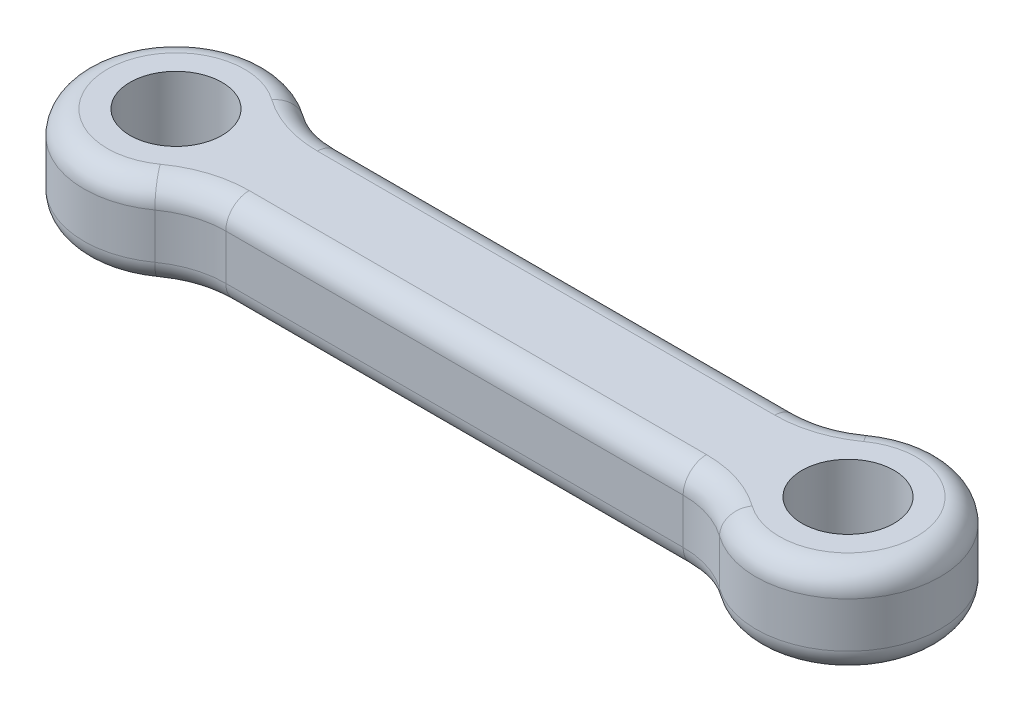
ISO-10303-21;
HEADER;
FILE_DESCRIPTION(('STEP AP214'),'2;1');
FILE_NAME('part.step','',(''),(''),'','','');
FILE_SCHEMA(('AUTOMOTIVE_DESIGN { 1 0 10303 214 1 1 1 1 }'));
ENDSEC;
DATA;
#1=APPLICATION_CONTEXT('core data for automotive mechanical design processes');
#2=APPLICATION_PROTOCOL_DEFINITION('international standard','automotive_design',2000,#1);
#3=PRODUCT_CONTEXT('',#1,'mechanical');
#4=PRODUCT('Part','Part','',(#3));
#5=PRODUCT_RELATED_PRODUCT_CATEGORY('part','',(#4));
#6=PRODUCT_DEFINITION_FORMATION('','',#4);
#7=PRODUCT_DEFINITION_CONTEXT('part definition',#1,'design');
#8=PRODUCT_DEFINITION('design','',#6,#7);
#9=PRODUCT_DEFINITION_SHAPE('','',#8);
#10=(LENGTH_UNIT() NAMED_UNIT(*) SI_UNIT(.MILLI.,.METRE.));
#11=(NAMED_UNIT(*) PLANE_ANGLE_UNIT() SI_UNIT($,.RADIAN.));
#12=(NAMED_UNIT(*) SI_UNIT($,.STERADIAN.) SOLID_ANGLE_UNIT());
#13=UNCERTAINTY_MEASURE_WITH_UNIT(LENGTH_MEASURE(1.E-05),#10,'distance_accuracy_value','');
#14=(GEOMETRIC_REPRESENTATION_CONTEXT(3) GLOBAL_UNCERTAINTY_ASSIGNED_CONTEXT((#13)) GLOBAL_UNIT_ASSIGNED_CONTEXT((#10,
#11,#12)) REPRESENTATION_CONTEXT('',''));
#15=CARTESIAN_POINT('',(0.,0.,0.));
#16=DIRECTION('',(0.,0.,1.));
#17=DIRECTION('',(1.,0.,0.));
#18=AXIS2_PLACEMENT_3D('',#15,#16,#17);
#19=CARTESIAN_POINT('',(1.85508771879827,8.3,-10.725));
#20=DIRECTION('',(0.,1.,0.));
#21=DIRECTION('',(0.,0.,1.));
#22=AXIS2_PLACEMENT_3D('',#19,#20,#21);
#23=PLANE('',#22);
#24=CARTESIAN_POINT('',(34.6449122812017,8.3,10.725));
#25=DIRECTION('',(0.,1.,0.));
#26=DIRECTION('',(0.,0.,1.));
#27=AXIS2_PLACEMENT_3D('',#24,#25,#26);
#28=CIRCLE('',#27,8.2764);
#29=CARTESIAN_POINT('',(34.6449122812017,8.3,2.4486));
#30=VERTEX_POINT('',#29);
#31=CARTESIAN_POINT('',(39.4697322808882,8.3,4.000425));
#32=VERTEX_POINT('',#31);
#33=EDGE_CURVE('E268',#30,#32,#28,.F.);
#34=ORIENTED_EDGE('',*,*,#33,.T.);
#35=CARTESIAN_POINT('',(42.34,8.3,0.));
#36=DIRECTION('',(0.,1.,0.));
#37=DIRECTION('',(0.,0.,1.));
#38=AXIS2_PLACEMENT_3D('',#35,#36,#37);
#39=CIRCLE('',#38,4.9236);
#40=CARTESIAN_POINT('',(39.4697322808882,8.3,-4.000425));
#41=VERTEX_POINT('',#40);
#42=EDGE_CURVE('E155',#32,#41,#39,.T.);
#43=ORIENTED_EDGE('',*,*,#42,.T.);
#44=CARTESIAN_POINT('',(34.6449122812017,8.3,-10.725));
#45=DIRECTION('',(0.,1.,0.));
#46=DIRECTION('',(0.,0.,1.));
#47=AXIS2_PLACEMENT_3D('',#44,#45,#46);
#48=CIRCLE('',#47,8.2764);
#49=CARTESIAN_POINT('',(34.6449122812017,8.3,-2.4486));
#50=VERTEX_POINT('',#49);
#51=EDGE_CURVE('E149',#41,#50,#48,.F.);
#52=ORIENTED_EDGE('',*,*,#51,.T.);
#53=DIRECTION('',(-1.,0.,0.));
#54=VECTOR('',#53,1.);
#55=CARTESIAN_POINT('',(1.85508771879827,8.3,-2.4486));
#56=LINE('',#55,#54);
#57=CARTESIAN_POINT('',(1.85508771879827,8.3,-2.4486));
#58=VERTEX_POINT('',#57);
#59=EDGE_CURVE('E152',#50,#58,#56,.T.);
#60=ORIENTED_EDGE('',*,*,#59,.T.);
#61=CARTESIAN_POINT('',(1.85508771879827,8.3,-10.725));
#62=DIRECTION('',(0.,1.,0.));
#63=DIRECTION('',(0.,0.,1.));
#64=AXIS2_PLACEMENT_3D('',#61,#62,#63);
#65=CIRCLE('',#64,8.2764);
#66=CARTESIAN_POINT('',(-2.96973228088825,8.3,-4.000425));
#67=VERTEX_POINT('',#66);
#68=EDGE_CURVE('E159',#58,#67,#65,.F.);
#69=ORIENTED_EDGE('',*,*,#68,.T.);
#70=CARTESIAN_POINT('',(-5.84000000000001,8.3,0.));
#71=DIRECTION('',(0.,1.,0.));
#72=DIRECTION('',(0.,0.,1.));
#73=AXIS2_PLACEMENT_3D('',#70,#71,#72);
#74=CIRCLE('',#73,4.9236);
#75=CARTESIAN_POINT('',(-2.96973228088825,8.3,4.000425));
#76=VERTEX_POINT('',#75);
#77=EDGE_CURVE('E274',#67,#76,#74,.T.);
#78=ORIENTED_EDGE('',*,*,#77,.T.);
#79=CARTESIAN_POINT('',(1.85508771879827,8.3,10.725));
#80=DIRECTION('',(0.,1.,0.));
#81=DIRECTION('',(0.,0.,1.));
#82=AXIS2_PLACEMENT_3D('',#79,#80,#81);
#83=CIRCLE('',#82,8.2764);
#84=CARTESIAN_POINT('',(1.85508771879827,8.3,2.4486));
#85=VERTEX_POINT('',#84);
#86=EDGE_CURVE('E272',#76,#85,#83,.F.);
#87=ORIENTED_EDGE('',*,*,#86,.T.);
#88=DIRECTION('',(1.,0.,0.));
#89=VECTOR('',#88,1.);
#90=CARTESIAN_POINT('',(34.6449122812017,8.3,2.4486));
#91=LINE('',#90,#89);
#92=EDGE_CURVE('E270',#85,#30,#91,.T.);
#93=ORIENTED_EDGE('',*,*,#92,.T.);
#94=EDGE_LOOP('',(#34,#43,#52,#60,#69,#78,#87,#93));
#95=FACE_BOUND('',#94,.T.);
#96=CARTESIAN_POINT('',(-5.84000000000001,8.3,0.));
#97=DIRECTION('',(0.,1.,0.));
#98=DIRECTION('',(0.,0.,1.));
#99=AXIS2_PLACEMENT_3D('',#96,#97,#98);
#100=CIRCLE('',#99,3.3);
#101=CARTESIAN_POINT('',(-5.84000000000001,8.3,3.3));
#102=VERTEX_POINT('',#101);
#103=EDGE_CURVE('E298',#102,#102,#100,.T.);
#104=ORIENTED_EDGE('',*,*,#103,.F.);
#105=EDGE_LOOP('',(#104));
#106=FACE_BOUND('',#105,.T.);
#107=CARTESIAN_POINT('',(42.34,8.3,0.));
#108=DIRECTION('',(0.,1.,0.));
#109=DIRECTION('',(0.,0.,-1.));
#110=AXIS2_PLACEMENT_3D('',#107,#108,#109);
#111=CIRCLE('',#110,3.3);
#112=CARTESIAN_POINT('',(42.34,8.3,-3.3));
#113=VERTEX_POINT('',#112);
#114=EDGE_CURVE('E302',#113,#113,#111,.T.);
#115=ORIENTED_EDGE('',*,*,#114,.F.);
#116=EDGE_LOOP('',(#115));
#117=FACE_BOUND('',#116,.T.);
#118=ADVANCED_FACE('F34',(#95,#106,#117),#23,.T.);
#119=CARTESIAN_POINT('',(1.85508771879827,1.7,-10.725));
#120=DIRECTION('',(0.,1.,0.));
#121=DIRECTION('',(0.,0.,1.));
#122=AXIS2_PLACEMENT_3D('',#119,#120,#121);
#123=PLANE('',#122);
#124=CARTESIAN_POINT('',(1.85508771879827,1.7,10.725));
#125=DIRECTION('',(0.,1.,0.));
#126=DIRECTION('',(0.,0.,1.));
#127=AXIS2_PLACEMENT_3D('',#124,#125,#126);
#128=CIRCLE('',#127,8.2764);
#129=CARTESIAN_POINT('',(1.85508771879827,1.7,2.4486));
#130=VERTEX_POINT('',#129);
#131=CARTESIAN_POINT('',(-2.96973228088825,1.7,4.000425));
#132=VERTEX_POINT('',#131);
#133=EDGE_CURVE('E227',#130,#132,#128,.T.);
#134=ORIENTED_EDGE('',*,*,#133,.T.);
#135=CARTESIAN_POINT('',(-5.84000000000001,1.7,0.));
#136=DIRECTION('',(0.,1.,0.));
#137=DIRECTION('',(0.,0.,1.));
#138=AXIS2_PLACEMENT_3D('',#135,#136,#137);
#139=CIRCLE('',#138,4.9236);
#140=CARTESIAN_POINT('',(-2.96973228088825,1.7,-4.000425));
#141=VERTEX_POINT('',#140);
#142=EDGE_CURVE('E224',#132,#141,#139,.F.);
#143=ORIENTED_EDGE('',*,*,#142,.T.);
#144=CARTESIAN_POINT('',(1.85508771879827,1.7,-10.725));
#145=DIRECTION('',(0.,1.,0.));
#146=DIRECTION('',(0.,0.,1.));
#147=AXIS2_PLACEMENT_3D('',#144,#145,#146);
#148=CIRCLE('',#147,8.2764);
#149=CARTESIAN_POINT('',(1.85508771879827,1.7,-2.4486));
#150=VERTEX_POINT('',#149);
#151=EDGE_CURVE('E239',#141,#150,#148,.T.);
#152=ORIENTED_EDGE('',*,*,#151,.T.);
#153=DIRECTION('',(-1.,0.,0.));
#154=VECTOR('',#153,1.);
#155=CARTESIAN_POINT('',(1.85508771879827,1.7,-2.4486));
#156=LINE('',#155,#154);
#157=CARTESIAN_POINT('',(34.6449122812017,1.7,-2.4486));
#158=VERTEX_POINT('',#157);
#159=EDGE_CURVE('E237',#150,#158,#156,.F.);
#160=ORIENTED_EDGE('',*,*,#159,.T.);
#161=CARTESIAN_POINT('',(34.6449122812017,1.7,-10.725));
#162=DIRECTION('',(0.,1.,0.));
#163=DIRECTION('',(0.,0.,1.));
#164=AXIS2_PLACEMENT_3D('',#161,#162,#163);
#165=CIRCLE('',#164,8.2764);
#166=CARTESIAN_POINT('',(39.4697322808882,1.7,-4.000425));
#167=VERTEX_POINT('',#166);
#168=EDGE_CURVE('E235',#158,#167,#165,.T.);
#169=ORIENTED_EDGE('',*,*,#168,.T.);
#170=CARTESIAN_POINT('',(42.34,1.7,0.));
#171=DIRECTION('',(0.,1.,0.));
#172=DIRECTION('',(0.,0.,1.));
#173=AXIS2_PLACEMENT_3D('',#170,#171,#172);
#174=CIRCLE('',#173,4.9236);
#175=CARTESIAN_POINT('',(39.4697322808882,1.7,4.000425));
#176=VERTEX_POINT('',#175);
#177=EDGE_CURVE('E233',#167,#176,#174,.F.);
#178=ORIENTED_EDGE('',*,*,#177,.T.);
#179=CARTESIAN_POINT('',(34.6449122812017,1.7,10.725));
#180=DIRECTION('',(0.,1.,0.));
#181=DIRECTION('',(0.,0.,1.));
#182=AXIS2_PLACEMENT_3D('',#179,#180,#181);
#183=CIRCLE('',#182,8.2764);
#184=CARTESIAN_POINT('',(34.6449122812017,1.7,2.4486));
#185=VERTEX_POINT('',#184);
#186=EDGE_CURVE('E231',#176,#185,#183,.T.);
#187=ORIENTED_EDGE('',*,*,#186,.T.);
#188=DIRECTION('',(1.,0.,0.));
#189=VECTOR('',#188,1.);
#190=CARTESIAN_POINT('',(1.85508771879827,1.7,2.4486));
#191=LINE('',#190,#189);
#192=EDGE_CURVE('E229',#185,#130,#191,.F.);
#193=ORIENTED_EDGE('',*,*,#192,.T.);
#194=EDGE_LOOP('',(#134,#143,#152,#160,#169,#178,#187,#193));
#195=FACE_BOUND('',#194,.T.);
#196=CARTESIAN_POINT('',(-5.84000000000001,1.7,0.));
#197=DIRECTION('',(0.,1.,0.));
#198=DIRECTION('',(0.,0.,1.));
#199=AXIS2_PLACEMENT_3D('',#196,#197,#198);
#200=CIRCLE('',#199,3.3);
#201=CARTESIAN_POINT('',(-5.84000000000001,1.7,3.3));
#202=VERTEX_POINT('',#201);
#203=EDGE_CURVE('E299',#202,#202,#200,.T.);
#204=ORIENTED_EDGE('',*,*,#203,.T.);
#205=EDGE_LOOP('',(#204));
#206=FACE_BOUND('',#205,.T.);
#207=CARTESIAN_POINT('',(42.34,1.7,0.));
#208=DIRECTION('',(0.,1.,0.));
#209=DIRECTION('',(0.,0.,-1.));
#210=AXIS2_PLACEMENT_3D('',#207,#208,#209);
#211=CIRCLE('',#210,3.3);
#212=CARTESIAN_POINT('',(42.34,1.7,-3.3));
#213=VERTEX_POINT('',#212);
#214=EDGE_CURVE('E192',#213,#213,#211,.T.);
#215=ORIENTED_EDGE('',*,*,#214,.T.);
#216=EDGE_LOOP('',(#215));
#217=FACE_BOUND('',#216,.T.);
#218=ADVANCED_FACE('F314',(#195,#206,#217),#123,.F.);
#219=CARTESIAN_POINT('',(1.85508771879827,8.3,-10.725));
#220=DIRECTION('',(0.,-1.,0.));
#221=DIRECTION('',(0.,0.,-1.));
#222=AXIS2_PLACEMENT_3D('',#219,#220,#221);
#223=CYLINDRICAL_SURFACE('',#222,6.6);
#224=DIRECTION('',(0.,-1.,0.));
#225=VECTOR('',#224,1.);
#226=CARTESIAN_POINT('',(-1.99245614060087,8.3,-5.3625));
#227=LINE('',#226,#225);
#228=CARTESIAN_POINT('',(-1.99245614060087,6.6236,-5.3625));
#229=VERTEX_POINT('',#228);
#230=CARTESIAN_POINT('',(-1.99245614060087,3.3764,-5.3625));
#231=VERTEX_POINT('',#230);
#232=EDGE_CURVE('E169',#229,#231,#227,.T.);
#233=ORIENTED_EDGE('',*,*,#232,.F.);
#234=CARTESIAN_POINT('',(1.85508771879827,6.6236,-10.725));
#235=DIRECTION('',(0.,1.,0.));
#236=DIRECTION('',(0.,0.,1.));
#237=AXIS2_PLACEMENT_3D('',#234,#235,#236);
#238=CIRCLE('',#237,6.6);
#239=CARTESIAN_POINT('',(1.85508771879827,6.6236,-4.125));
#240=VERTEX_POINT('',#239);
#241=EDGE_CURVE('E241',#229,#240,#238,.T.);
#242=ORIENTED_EDGE('',*,*,#241,.T.);
#243=DIRECTION('',(0.,-1.,0.));
#244=VECTOR('',#243,1.);
#245=CARTESIAN_POINT('',(1.85508771879827,8.3,-4.125));
#246=LINE('',#245,#244);
#247=CARTESIAN_POINT('',(1.85508771879827,3.3764,-4.125));
#248=VERTEX_POINT('',#247);
#249=EDGE_CURVE('E295',#240,#248,#246,.T.);
#250=ORIENTED_EDGE('',*,*,#249,.T.);
#251=CARTESIAN_POINT('',(1.85508771879827,3.3764,-10.725));
#252=DIRECTION('',(0.,1.,0.));
#253=DIRECTION('',(0.,0.,1.));
#254=AXIS2_PLACEMENT_3D('',#251,#252,#253);
#255=CIRCLE('',#254,6.6);
#256=EDGE_CURVE('E243',#248,#231,#255,.F.);
#257=ORIENTED_EDGE('',*,*,#256,.T.);
#258=EDGE_LOOP('',(#233,#242,#250,#257));
#259=FACE_BOUND('',#258,.T.);
#260=ADVANCED_FACE('F319',(#259),#223,.F.);
#261=CARTESIAN_POINT('',(-5.84000000000001,8.3,0.));
#262=DIRECTION('',(0.,-1.,0.));
#263=DIRECTION('',(0.,0.,-1.));
#264=AXIS2_PLACEMENT_3D('',#261,#262,#263);
#265=CYLINDRICAL_SURFACE('',#264,6.6);
#266=DIRECTION('',(0.,-1.,0.));
#267=VECTOR('',#266,1.);
#268=CARTESIAN_POINT('',(-1.99245614060087,8.3,5.3625));
#269=LINE('',#268,#267);
#270=CARTESIAN_POINT('',(-1.99245614060087,6.6236,5.3625));
#271=VERTEX_POINT('',#270);
#272=CARTESIAN_POINT('',(-1.99245614060087,3.3764,5.3625));
#273=VERTEX_POINT('',#272);
#274=EDGE_CURVE('E279',#271,#273,#269,.T.);
#275=ORIENTED_EDGE('',*,*,#274,.F.);
#276=CARTESIAN_POINT('',(-5.84000000000001,6.6236,0.));
#277=DIRECTION('',(0.,1.,0.));
#278=DIRECTION('',(0.,0.,1.));
#279=AXIS2_PLACEMENT_3D('',#276,#277,#278);
#280=CIRCLE('',#279,6.6);
#281=EDGE_CURVE('E245',#271,#229,#280,.F.);
#282=ORIENTED_EDGE('',*,*,#281,.T.);
#283=ORIENTED_EDGE('',*,*,#232,.T.);
#284=CARTESIAN_POINT('',(-5.84000000000001,3.3764,0.));
#285=DIRECTION('',(0.,1.,0.));
#286=DIRECTION('',(0.,0.,1.));
#287=AXIS2_PLACEMENT_3D('',#284,#285,#286);
#288=CIRCLE('',#287,6.6);
#289=EDGE_CURVE('E247',#231,#273,#288,.T.);
#290=ORIENTED_EDGE('',*,*,#289,.T.);
#291=EDGE_LOOP('',(#275,#282,#283,#290));
#292=FACE_BOUND('',#291,.T.);
#293=ADVANCED_FACE('F347',(#292),#265,.T.);
#294=CARTESIAN_POINT('',(1.85508771879827,8.3,10.725));
#295=DIRECTION('',(0.,-1.,0.));
#296=DIRECTION('',(0.,0.,-1.));
#297=AXIS2_PLACEMENT_3D('',#294,#295,#296);
#298=CYLINDRICAL_SURFACE('',#297,6.6);
#299=DIRECTION('',(0.,-1.,0.));
#300=VECTOR('',#299,1.);
#301=CARTESIAN_POINT('',(1.85508771879827,8.3,4.125));
#302=LINE('',#301,#300);
#303=CARTESIAN_POINT('',(1.85508771879827,6.6236,4.125));
#304=VERTEX_POINT('',#303);
#305=CARTESIAN_POINT('',(1.85508771879827,3.3764,4.125));
#306=VERTEX_POINT('',#305);
#307=EDGE_CURVE('E282',#304,#306,#302,.T.);
#308=ORIENTED_EDGE('',*,*,#307,.F.);
#309=CARTESIAN_POINT('',(1.85508771879827,6.6236,10.725));
#310=DIRECTION('',(0.,1.,0.));
#311=DIRECTION('',(0.,0.,1.));
#312=AXIS2_PLACEMENT_3D('',#309,#310,#311);
#313=CIRCLE('',#312,6.6);
#314=EDGE_CURVE('E250',#304,#271,#313,.T.);
#315=ORIENTED_EDGE('',*,*,#314,.T.);
#316=ORIENTED_EDGE('',*,*,#274,.T.);
#317=CARTESIAN_POINT('',(1.85508771879827,3.3764,10.725));
#318=DIRECTION('',(0.,1.,0.));
#319=DIRECTION('',(0.,0.,1.));
#320=AXIS2_PLACEMENT_3D('',#317,#318,#319);
#321=CIRCLE('',#320,6.6);
#322=EDGE_CURVE('E252',#273,#306,#321,.F.);
#323=ORIENTED_EDGE('',*,*,#322,.T.);
#324=EDGE_LOOP('',(#308,#315,#316,#323));
#325=FACE_BOUND('',#324,.T.);
#326=ADVANCED_FACE('F343',(#325),#298,.F.);
#327=CARTESIAN_POINT('',(1.85508771879827,8.3,4.125));
#328=DIRECTION('',(0.,0.,-1.));
#329=DIRECTION('',(-1.,0.,0.));
#330=AXIS2_PLACEMENT_3D('',#327,#328,#329);
#331=PLANE('',#330);
#332=DIRECTION('',(0.,-1.,0.));
#333=VECTOR('',#332,1.);
#334=CARTESIAN_POINT('',(34.6449122812017,8.3,4.125));
#335=LINE('',#334,#333);
#336=CARTESIAN_POINT('',(34.6449122812017,6.6236,4.125));
#337=VERTEX_POINT('',#336);
#338=CARTESIAN_POINT('',(34.6449122812017,3.3764,4.125));
#339=VERTEX_POINT('',#338);
#340=EDGE_CURVE('E285',#337,#339,#335,.T.);
#341=ORIENTED_EDGE('',*,*,#340,.F.);
#342=DIRECTION('',(1.,0.,0.));
#343=VECTOR('',#342,1.);
#344=CARTESIAN_POINT('',(1.85508771879827,6.6236,4.125));
#345=LINE('',#344,#343);
#346=EDGE_CURVE('E254',#337,#304,#345,.F.);
#347=ORIENTED_EDGE('',*,*,#346,.T.);
#348=ORIENTED_EDGE('',*,*,#307,.T.);
#349=DIRECTION('',(1.,0.,0.));
#350=VECTOR('',#349,1.);
#351=CARTESIAN_POINT('',(1.85508771879827,3.3764,4.125));
#352=LINE('',#351,#350);
#353=EDGE_CURVE('E256',#306,#339,#352,.T.);
#354=ORIENTED_EDGE('',*,*,#353,.T.);
#355=EDGE_LOOP('',(#341,#347,#348,#354));
#356=FACE_BOUND('',#355,.T.);
#357=ADVANCED_FACE('F339',(#356),#331,.F.);
#358=CARTESIAN_POINT('',(34.6449122812017,8.3,10.725));
#359=DIRECTION('',(0.,-1.,0.));
#360=DIRECTION('',(0.,0.,-1.));
#361=AXIS2_PLACEMENT_3D('',#358,#359,#360);
#362=CYLINDRICAL_SURFACE('',#361,6.6);
#363=DIRECTION('',(0.,-1.,0.));
#364=VECTOR('',#363,1.);
#365=CARTESIAN_POINT('',(38.4924561406009,8.3,5.3625));
#366=LINE('',#365,#364);
#367=CARTESIAN_POINT('',(38.4924561406009,6.6236,5.3625));
#368=VERTEX_POINT('',#367);
#369=CARTESIAN_POINT('',(38.4924561406009,3.3764,5.3625));
#370=VERTEX_POINT('',#369);
#371=EDGE_CURVE('E288',#368,#370,#366,.T.);
#372=ORIENTED_EDGE('',*,*,#371,.F.);
#373=CARTESIAN_POINT('',(34.6449122812017,6.6236,10.725));
#374=DIRECTION('',(0.,1.,0.));
#375=DIRECTION('',(0.,0.,1.));
#376=AXIS2_PLACEMENT_3D('',#373,#374,#375);
#377=CIRCLE('',#376,6.6);
#378=EDGE_CURVE('E258',#368,#337,#377,.T.);
#379=ORIENTED_EDGE('',*,*,#378,.T.);
#380=ORIENTED_EDGE('',*,*,#340,.T.);
#381=CARTESIAN_POINT('',(34.6449122812017,3.3764,10.725));
#382=DIRECTION('',(0.,1.,0.));
#383=DIRECTION('',(0.,0.,1.));
#384=AXIS2_PLACEMENT_3D('',#381,#382,#383);
#385=CIRCLE('',#384,6.6);
#386=EDGE_CURVE('E260',#339,#370,#385,.F.);
#387=ORIENTED_EDGE('',*,*,#386,.T.);
#388=EDGE_LOOP('',(#372,#379,#380,#387));
#389=FACE_BOUND('',#388,.T.);
#390=ADVANCED_FACE('F335',(#389),#362,.F.);
#391=CARTESIAN_POINT('',(42.34,8.3,0.));
#392=DIRECTION('',(0.,-1.,0.));
#393=DIRECTION('',(0.,0.,-1.));
#394=AXIS2_PLACEMENT_3D('',#391,#392,#393);
#395=CYLINDRICAL_SURFACE('',#394,6.6);
#396=DIRECTION('',(0.,-1.,0.));
#397=VECTOR('',#396,1.);
#398=CARTESIAN_POINT('',(38.4924561406009,8.3,-5.3625));
#399=LINE('',#398,#397);
#400=CARTESIAN_POINT('',(38.4924561406009,6.6236,-5.3625));
#401=VERTEX_POINT('',#400);
#402=CARTESIAN_POINT('',(38.4924561406009,3.3764,-5.3625));
#403=VERTEX_POINT('',#402);
#404=EDGE_CURVE('E291',#401,#403,#399,.T.);
#405=ORIENTED_EDGE('',*,*,#404,.F.);
#406=CARTESIAN_POINT('',(42.34,6.6236,0.));
#407=DIRECTION('',(0.,1.,0.));
#408=DIRECTION('',(0.,0.,1.));
#409=AXIS2_PLACEMENT_3D('',#406,#407,#408);
#410=CIRCLE('',#409,6.6);
#411=EDGE_CURVE('E262',#401,#368,#410,.F.);
#412=ORIENTED_EDGE('',*,*,#411,.T.);
#413=ORIENTED_EDGE('',*,*,#371,.T.);
#414=CARTESIAN_POINT('',(42.34,3.3764,0.));
#415=DIRECTION('',(0.,1.,0.));
#416=DIRECTION('',(0.,0.,1.));
#417=AXIS2_PLACEMENT_3D('',#414,#415,#416);
#418=CIRCLE('',#417,6.6);
#419=EDGE_CURVE('E265',#370,#403,#418,.T.);
#420=ORIENTED_EDGE('',*,*,#419,.T.);
#421=EDGE_LOOP('',(#405,#412,#413,#420));
#422=FACE_BOUND('',#421,.T.);
#423=ADVANCED_FACE('F332',(#422),#395,.T.);
#424=CARTESIAN_POINT('',(34.6449122812017,8.3,-10.725));
#425=DIRECTION('',(0.,-1.,0.));
#426=DIRECTION('',(0.,0.,-1.));
#427=AXIS2_PLACEMENT_3D('',#424,#425,#426);
#428=CYLINDRICAL_SURFACE('',#427,6.6);
#429=ORIENTED_EDGE('',*,*,#404,.T.);
#430=CARTESIAN_POINT('',(34.6449122812017,3.3764,-10.725));
#431=DIRECTION('',(0.,1.,0.));
#432=DIRECTION('',(0.,0.,1.));
#433=AXIS2_PLACEMENT_3D('',#430,#431,#432);
#434=CIRCLE('',#433,6.6);
#435=CARTESIAN_POINT('',(34.6449122812017,3.3764,-4.125));
#436=VERTEX_POINT('',#435);
#437=EDGE_CURVE('E51',#403,#436,#434,.F.);
#438=ORIENTED_EDGE('',*,*,#437,.T.);
#439=DIRECTION('',(0.,-1.,0.));
#440=VECTOR('',#439,1.);
#441=CARTESIAN_POINT('',(34.6449122812017,8.3,-4.125));
#442=LINE('',#441,#440);
#443=CARTESIAN_POINT('',(34.6449122812017,6.6236,-4.125));
#444=VERTEX_POINT('',#443);
#445=EDGE_CURVE('E293',#444,#436,#442,.T.);
#446=ORIENTED_EDGE('',*,*,#445,.F.);
#447=CARTESIAN_POINT('',(34.6449122812017,6.6236,-10.725));
#448=DIRECTION('',(0.,1.,0.));
#449=DIRECTION('',(0.,0.,1.));
#450=AXIS2_PLACEMENT_3D('',#447,#448,#449);
#451=CIRCLE('',#450,6.6);
#452=EDGE_CURVE('E172',#444,#401,#451,.T.);
#453=ORIENTED_EDGE('',*,*,#452,.T.);
#454=EDGE_LOOP('',(#429,#438,#446,#453));
#455=FACE_BOUND('',#454,.T.);
#456=ADVANCED_FACE('F329',(#455),#428,.F.);
#457=CARTESIAN_POINT('',(1.85508771879827,8.3,-4.125));
#458=DIRECTION('',(0.,0.,1.));
#459=DIRECTION('',(1.,0.,0.));
#460=AXIS2_PLACEMENT_3D('',#457,#458,#459);
#461=PLANE('',#460);
#462=ORIENTED_EDGE('',*,*,#445,.T.);
#463=DIRECTION('',(-1.,0.,0.));
#464=VECTOR('',#463,1.);
#465=CARTESIAN_POINT('',(1.85508771879827,3.3764,-4.125));
#466=LINE('',#465,#464);
#467=EDGE_CURVE('E11',#436,#248,#466,.T.);
#468=ORIENTED_EDGE('',*,*,#467,.T.);
#469=ORIENTED_EDGE('',*,*,#249,.F.);
#470=DIRECTION('',(-1.,0.,0.));
#471=VECTOR('',#470,1.);
#472=CARTESIAN_POINT('',(34.6449122812017,6.6236,-4.125));
#473=LINE('',#472,#471);
#474=EDGE_CURVE('E43',#240,#444,#473,.F.);
#475=ORIENTED_EDGE('',*,*,#474,.T.);
#476=EDGE_LOOP('',(#462,#468,#469,#475));
#477=FACE_BOUND('',#476,.T.);
#478=ADVANCED_FACE('F326',(#477),#461,.F.);
#479=CARTESIAN_POINT('',(-5.84000000000001,8.3,0.));
#480=DIRECTION('',(0.,-1.,0.));
#481=DIRECTION('',(0.,0.,-1.));
#482=AXIS2_PLACEMENT_3D('',#479,#480,#481);
#483=CYLINDRICAL_SURFACE('',#482,3.3);
#484=ORIENTED_EDGE('',*,*,#103,.T.);
#485=EDGE_LOOP('',(#484));
#486=FACE_BOUND('',#485,.T.);
#487=ORIENTED_EDGE('',*,*,#203,.F.);
#488=EDGE_LOOP('',(#487));
#489=FACE_BOUND('',#488,.T.);
#490=ADVANCED_FACE('F323',(#486,#489),#483,.F.);
#491=CARTESIAN_POINT('',(42.34,8.3,0.));
#492=DIRECTION('',(0.,-1.,0.));
#493=DIRECTION('',(0.,0.,-1.));
#494=AXIS2_PLACEMENT_3D('',#491,#492,#493);
#495=CYLINDRICAL_SURFACE('',#494,3.3);
#496=ORIENTED_EDGE('',*,*,#114,.T.);
#497=EDGE_LOOP('',(#496));
#498=FACE_BOUND('',#497,.T.);
#499=ORIENTED_EDGE('',*,*,#214,.F.);
#500=EDGE_LOOP('',(#499));
#501=FACE_BOUND('',#500,.T.);
#502=ADVANCED_FACE('F310',(#498,#501),#495,.F.);
#503=CARTESIAN_POINT('',(-5.84000000000001,6.6236,0.));
#504=DIRECTION('',(0.,1.,0.));
#505=DIRECTION('',(0.,0.,1.));
#506=AXIS2_PLACEMENT_3D('',#503,#504,#505);
#507=TOROIDAL_SURFACE('',#506,4.9236,1.6764);
#508=CARTESIAN_POINT('',(-2.96973228088825,6.6236,-4.000425));
#509=DIRECTION('',(0.8125,0.,0.582961190818051));
#510=DIRECTION('',(0.582961190818051,0.,-0.8125));
#511=AXIS2_PLACEMENT_3D('',#508,#509,#510);
#512=CIRCLE('',#511,1.6764);
#513=EDGE_CURVE('E186',#229,#67,#512,.T.);
#514=ORIENTED_EDGE('',*,*,#513,.F.);
#515=ORIENTED_EDGE('',*,*,#281,.F.);
#516=CARTESIAN_POINT('',(-2.96973228088825,6.6236,4.000425));
#517=DIRECTION('',(0.8125,0.,-0.582961190818051));
#518=DIRECTION('',(-0.582961190818051,0.,-0.8125));
#519=AXIS2_PLACEMENT_3D('',#516,#517,#518);
#520=CIRCLE('',#519,1.6764);
#521=EDGE_CURVE('E189',#76,#271,#520,.T.);
#522=ORIENTED_EDGE('',*,*,#521,.F.);
#523=ORIENTED_EDGE('',*,*,#77,.F.);
#524=EDGE_LOOP('',(#514,#515,#522,#523));
#525=FACE_BOUND('',#524,.T.);
#526=ADVANCED_FACE('F377',(#525),#507,.T.);
#527=CARTESIAN_POINT('',(1.85508771879827,6.6236,10.725));
#528=DIRECTION('',(0.,1.,0.));
#529=DIRECTION('',(0.,0.,1.));
#530=AXIS2_PLACEMENT_3D('',#527,#528,#529);
#531=TOROIDAL_SURFACE('',#530,8.2764,1.6764);
#532=ORIENTED_EDGE('',*,*,#521,.T.);
#533=ORIENTED_EDGE('',*,*,#314,.F.);
#534=CARTESIAN_POINT('',(1.85508771879827,6.6236,2.4486));
#535=DIRECTION('',(1.,0.,0.));
#536=DIRECTION('',(0.,0.,-1.));
#537=AXIS2_PLACEMENT_3D('',#534,#535,#536);
#538=CIRCLE('',#537,1.6764);
#539=EDGE_CURVE('E183',#85,#304,#538,.T.);
#540=ORIENTED_EDGE('',*,*,#539,.F.);
#541=ORIENTED_EDGE('',*,*,#86,.F.);
#542=EDGE_LOOP('',(#532,#533,#540,#541));
#543=FACE_BOUND('',#542,.T.);
#544=ADVANCED_FACE('F373',(#543),#531,.T.);
#545=CARTESIAN_POINT('',(1.85508771879827,6.6236,-10.725));
#546=DIRECTION('',(0.,1.,0.));
#547=DIRECTION('',(0.,0.,1.));
#548=AXIS2_PLACEMENT_3D('',#545,#546,#547);
#549=TOROIDAL_SURFACE('',#548,8.2764,1.6764);
#550=ORIENTED_EDGE('',*,*,#513,.T.);
#551=ORIENTED_EDGE('',*,*,#68,.F.);
#552=CARTESIAN_POINT('',(1.85508771879827,6.6236,-2.4486));
#553=DIRECTION('',(1.,0.,0.));
#554=DIRECTION('',(0.,0.,-1.));
#555=AXIS2_PLACEMENT_3D('',#552,#553,#554);
#556=CIRCLE('',#555,1.6764);
#557=EDGE_CURVE('E168',#240,#58,#556,.T.);
#558=ORIENTED_EDGE('',*,*,#557,.F.);
#559=ORIENTED_EDGE('',*,*,#241,.F.);
#560=EDGE_LOOP('',(#550,#551,#558,#559));
#561=FACE_BOUND('',#560,.T.);
#562=ADVANCED_FACE('F369',(#561),#549,.T.);
#563=CARTESIAN_POINT('',(1.85508771879827,6.6236,2.4486));
#564=DIRECTION('',(-1.,0.,0.));
#565=DIRECTION('',(0.,0.,1.));
#566=AXIS2_PLACEMENT_3D('',#563,#564,#565);
#567=CYLINDRICAL_SURFACE('',#566,1.6764);
#568=ORIENTED_EDGE('',*,*,#539,.T.);
#569=ORIENTED_EDGE('',*,*,#346,.F.);
#570=CARTESIAN_POINT('',(34.6449122812017,6.6236,2.4486));
#571=DIRECTION('',(1.,0.,0.));
#572=DIRECTION('',(0.,0.,-1.));
#573=AXIS2_PLACEMENT_3D('',#570,#571,#572);
#574=CIRCLE('',#573,1.6764);
#575=EDGE_CURVE('E173',#30,#337,#574,.T.);
#576=ORIENTED_EDGE('',*,*,#575,.F.);
#577=ORIENTED_EDGE('',*,*,#92,.F.);
#578=EDGE_LOOP('',(#568,#569,#576,#577));
#579=FACE_BOUND('',#578,.T.);
#580=ADVANCED_FACE('F366',(#579),#567,.T.);
#581=CARTESIAN_POINT('',(1.85508771879827,6.6236,-2.4486));
#582=DIRECTION('',(1.,0.,0.));
#583=DIRECTION('',(0.,0.,-1.));
#584=AXIS2_PLACEMENT_3D('',#581,#582,#583);
#585=CYLINDRICAL_SURFACE('',#584,1.6764);
#586=ORIENTED_EDGE('',*,*,#557,.T.);
#587=ORIENTED_EDGE('',*,*,#59,.F.);
#588=CARTESIAN_POINT('',(34.6449122812017,6.6236,-2.4486));
#589=DIRECTION('',(1.,0.,0.));
#590=DIRECTION('',(0.,0.,-1.));
#591=AXIS2_PLACEMENT_3D('',#588,#589,#590);
#592=CIRCLE('',#591,1.6764);
#593=EDGE_CURVE('E165',#444,#50,#592,.T.);
#594=ORIENTED_EDGE('',*,*,#593,.F.);
#595=ORIENTED_EDGE('',*,*,#474,.F.);
#596=EDGE_LOOP('',(#586,#587,#594,#595));
#597=FACE_BOUND('',#596,.T.);
#598=ADVANCED_FACE('F164',(#597),#585,.T.);
#599=CARTESIAN_POINT('',(34.6449122812017,6.6236,10.725));
#600=DIRECTION('',(0.,1.,0.));
#601=DIRECTION('',(0.,0.,1.));
#602=AXIS2_PLACEMENT_3D('',#599,#600,#601);
#603=TOROIDAL_SURFACE('',#602,8.2764,1.6764);
#604=ORIENTED_EDGE('',*,*,#575,.T.);
#605=ORIENTED_EDGE('',*,*,#378,.F.);
#606=CARTESIAN_POINT('',(39.4697322808882,6.6236,4.000425));
#607=DIRECTION('',(0.812500000000001,0.,0.582961190818049));
#608=DIRECTION('',(0.582961190818049,0.,-0.812500000000001));
#609=AXIS2_PLACEMENT_3D('',#606,#607,#608);
#610=CIRCLE('',#609,1.6764);
#611=EDGE_CURVE('E174',#32,#368,#610,.T.);
#612=ORIENTED_EDGE('',*,*,#611,.F.);
#613=ORIENTED_EDGE('',*,*,#33,.F.);
#614=EDGE_LOOP('',(#604,#605,#612,#613));
#615=FACE_BOUND('',#614,.T.);
#616=ADVANCED_FACE('F360',(#615),#603,.T.);
#617=CARTESIAN_POINT('',(34.6449122812017,6.6236,-10.725));
#618=DIRECTION('',(0.,1.,0.));
#619=DIRECTION('',(0.,0.,1.));
#620=AXIS2_PLACEMENT_3D('',#617,#618,#619);
#621=TOROIDAL_SURFACE('',#620,8.2764,1.6764);
#622=ORIENTED_EDGE('',*,*,#593,.T.);
#623=ORIENTED_EDGE('',*,*,#51,.F.);
#624=CARTESIAN_POINT('',(39.4697322808882,6.6236,-4.000425));
#625=DIRECTION('',(0.812500000000001,0.,-0.58296119081805));
#626=DIRECTION('',(-0.58296119081805,0.,-0.812500000000001));
#627=AXIS2_PLACEMENT_3D('',#624,#625,#626);
#628=CIRCLE('',#627,1.6764);
#629=EDGE_CURVE('E178',#401,#41,#628,.T.);
#630=ORIENTED_EDGE('',*,*,#629,.F.);
#631=ORIENTED_EDGE('',*,*,#452,.F.);
#632=EDGE_LOOP('',(#622,#623,#630,#631));
#633=FACE_BOUND('',#632,.T.);
#634=ADVANCED_FACE('F171',(#633),#621,.T.);
#635=CARTESIAN_POINT('',(42.34,6.6236,0.));
#636=DIRECTION('',(0.,1.,0.));
#637=DIRECTION('',(0.,0.,1.));
#638=AXIS2_PLACEMENT_3D('',#635,#636,#637);
#639=TOROIDAL_SURFACE('',#638,4.9236,1.6764);
#640=ORIENTED_EDGE('',*,*,#611,.T.);
#641=ORIENTED_EDGE('',*,*,#411,.F.);
#642=ORIENTED_EDGE('',*,*,#629,.T.);
#643=ORIENTED_EDGE('',*,*,#42,.F.);
#644=EDGE_LOOP('',(#640,#641,#642,#643));
#645=FACE_BOUND('',#644,.T.);
#646=ADVANCED_FACE('F355',(#645),#639,.T.);
#647=CARTESIAN_POINT('',(42.34,3.3764,0.));
#648=DIRECTION('',(0.,1.,0.));
#649=DIRECTION('',(0.,0.,1.));
#650=AXIS2_PLACEMENT_3D('',#647,#648,#649);
#651=TOROIDAL_SURFACE('',#650,4.9236,1.6764);
#652=CARTESIAN_POINT('',(39.4697322808882,3.3764,4.000425));
#653=DIRECTION('',(-0.812499999999999,0.,-0.582961190818052));
#654=DIRECTION('',(-0.582961190818052,0.,0.812499999999999));
#655=AXIS2_PLACEMENT_3D('',#652,#653,#654);
#656=CIRCLE('',#655,1.6764);
#657=EDGE_CURVE('E208',#176,#370,#656,.T.);
#658=ORIENTED_EDGE('',*,*,#657,.F.);
#659=ORIENTED_EDGE('',*,*,#177,.F.);
#660=CARTESIAN_POINT('',(39.4697322808882,3.3764,-4.000425));
#661=DIRECTION('',(-0.812499999999999,0.,0.582961190818052));
#662=DIRECTION('',(0.582961190818052,0.,0.812499999999999));
#663=AXIS2_PLACEMENT_3D('',#660,#661,#662);
#664=CIRCLE('',#663,1.6764);
#665=EDGE_CURVE('E38',#403,#167,#664,.T.);
#666=ORIENTED_EDGE('',*,*,#665,.F.);
#667=ORIENTED_EDGE('',*,*,#419,.F.);
#668=EDGE_LOOP('',(#658,#659,#666,#667));
#669=FACE_BOUND('',#668,.T.);
#670=ADVANCED_FACE('F36',(#669),#651,.T.);
#671=CARTESIAN_POINT('',(34.6449122812017,3.3764,-10.725));
#672=DIRECTION('',(0.,1.,0.));
#673=DIRECTION('',(0.,0.,1.));
#674=AXIS2_PLACEMENT_3D('',#671,#672,#673);
#675=TOROIDAL_SURFACE('',#674,8.2764,1.6764);
#676=ORIENTED_EDGE('',*,*,#665,.T.);
#677=ORIENTED_EDGE('',*,*,#168,.F.);
#678=CARTESIAN_POINT('',(34.6449122812017,3.3764,-2.4486));
#679=DIRECTION('',(-1.,0.,0.));
#680=DIRECTION('',(0.,0.,1.));
#681=AXIS2_PLACEMENT_3D('',#678,#679,#680);
#682=CIRCLE('',#681,1.6764);
#683=EDGE_CURVE('E206',#436,#158,#682,.T.);
#684=ORIENTED_EDGE('',*,*,#683,.F.);
#685=ORIENTED_EDGE('',*,*,#437,.F.);
#686=EDGE_LOOP('',(#676,#677,#684,#685));
#687=FACE_BOUND('',#686,.T.);
#688=ADVANCED_FACE('F404',(#687),#675,.T.);
#689=CARTESIAN_POINT('',(34.6449122812017,3.3764,10.725));
#690=DIRECTION('',(0.,1.,0.));
#691=DIRECTION('',(0.,0.,1.));
#692=AXIS2_PLACEMENT_3D('',#689,#690,#691);
#693=TOROIDAL_SURFACE('',#692,8.2764,1.6764);
#694=ORIENTED_EDGE('',*,*,#657,.T.);
#695=ORIENTED_EDGE('',*,*,#386,.F.);
#696=CARTESIAN_POINT('',(34.6449122812017,3.3764,2.4486));
#697=DIRECTION('',(-1.,0.,0.));
#698=DIRECTION('',(0.,0.,1.));
#699=AXIS2_PLACEMENT_3D('',#696,#697,#698);
#700=CIRCLE('',#699,1.6764);
#701=EDGE_CURVE('E203',#185,#339,#700,.T.);
#702=ORIENTED_EDGE('',*,*,#701,.F.);
#703=ORIENTED_EDGE('',*,*,#186,.F.);
#704=EDGE_LOOP('',(#694,#695,#702,#703));
#705=FACE_BOUND('',#704,.T.);
#706=ADVANCED_FACE('F401',(#705),#693,.T.);
#707=CARTESIAN_POINT('',(1.85508771879827,3.3764,-2.4486));
#708=DIRECTION('',(-1.,0.,0.));
#709=DIRECTION('',(0.,0.,1.));
#710=AXIS2_PLACEMENT_3D('',#707,#708,#709);
#711=CYLINDRICAL_SURFACE('',#710,1.6764);
#712=ORIENTED_EDGE('',*,*,#683,.T.);
#713=ORIENTED_EDGE('',*,*,#159,.F.);
#714=CARTESIAN_POINT('',(1.85508771879827,3.3764,-2.4486));
#715=DIRECTION('',(-1.,0.,0.));
#716=DIRECTION('',(0.,0.,1.));
#717=AXIS2_PLACEMENT_3D('',#714,#715,#716);
#718=CIRCLE('',#717,1.6764);
#719=EDGE_CURVE('E200',#248,#150,#718,.T.);
#720=ORIENTED_EDGE('',*,*,#719,.F.);
#721=ORIENTED_EDGE('',*,*,#467,.F.);
#722=EDGE_LOOP('',(#712,#713,#720,#721));
#723=FACE_BOUND('',#722,.T.);
#724=ADVANCED_FACE('F397',(#723),#711,.T.);
#725=CARTESIAN_POINT('',(1.85508771879827,3.3764,2.4486));
#726=DIRECTION('',(1.,0.,0.));
#727=DIRECTION('',(0.,0.,-1.));
#728=AXIS2_PLACEMENT_3D('',#725,#726,#727);
#729=CYLINDRICAL_SURFACE('',#728,1.6764);
#730=ORIENTED_EDGE('',*,*,#701,.T.);
#731=ORIENTED_EDGE('',*,*,#353,.F.);
#732=CARTESIAN_POINT('',(1.85508771879827,3.3764,2.4486));
#733=DIRECTION('',(-1.,0.,0.));
#734=DIRECTION('',(0.,0.,1.));
#735=AXIS2_PLACEMENT_3D('',#732,#733,#734);
#736=CIRCLE('',#735,1.6764);
#737=EDGE_CURVE('E197',#130,#306,#736,.T.);
#738=ORIENTED_EDGE('',*,*,#737,.F.);
#739=ORIENTED_EDGE('',*,*,#192,.F.);
#740=EDGE_LOOP('',(#730,#731,#738,#739));
#741=FACE_BOUND('',#740,.T.);
#742=ADVANCED_FACE('F393',(#741),#729,.T.);
#743=CARTESIAN_POINT('',(1.85508771879827,3.3764,-10.725));
#744=DIRECTION('',(0.,1.,0.));
#745=DIRECTION('',(0.,0.,1.));
#746=AXIS2_PLACEMENT_3D('',#743,#744,#745);
#747=TOROIDAL_SURFACE('',#746,8.2764,1.6764);
#748=ORIENTED_EDGE('',*,*,#719,.T.);
#749=ORIENTED_EDGE('',*,*,#151,.F.);
#750=CARTESIAN_POINT('',(-2.96973228088825,3.3764,-4.000425));
#751=DIRECTION('',(-0.8125,0.,-0.582961190818051));
#752=DIRECTION('',(-0.582961190818051,0.,0.8125));
#753=AXIS2_PLACEMENT_3D('',#750,#751,#752);
#754=CIRCLE('',#753,1.6764);
#755=EDGE_CURVE('E195',#231,#141,#754,.T.);
#756=ORIENTED_EDGE('',*,*,#755,.F.);
#757=ORIENTED_EDGE('',*,*,#256,.F.);
#758=EDGE_LOOP('',(#748,#749,#756,#757));
#759=FACE_BOUND('',#758,.T.);
#760=ADVANCED_FACE('F389',(#759),#747,.T.);
#761=CARTESIAN_POINT('',(1.85508771879827,3.3764,10.725));
#762=DIRECTION('',(0.,1.,0.));
#763=DIRECTION('',(0.,0.,1.));
#764=AXIS2_PLACEMENT_3D('',#761,#762,#763);
#765=TOROIDAL_SURFACE('',#764,8.2764,1.6764);
#766=ORIENTED_EDGE('',*,*,#737,.T.);
#767=ORIENTED_EDGE('',*,*,#322,.F.);
#768=CARTESIAN_POINT('',(-2.96973228088825,3.3764,4.000425));
#769=DIRECTION('',(-0.8125,0.,0.582961190818051));
#770=DIRECTION('',(0.582961190818051,0.,0.8125));
#771=AXIS2_PLACEMENT_3D('',#768,#769,#770);
#772=CIRCLE('',#771,1.6764);
#773=EDGE_CURVE('E193',#132,#273,#772,.T.);
#774=ORIENTED_EDGE('',*,*,#773,.F.);
#775=ORIENTED_EDGE('',*,*,#133,.F.);
#776=EDGE_LOOP('',(#766,#767,#774,#775));
#777=FACE_BOUND('',#776,.T.);
#778=ADVANCED_FACE('F385',(#777),#765,.T.);
#779=CARTESIAN_POINT('',(-5.84000000000001,3.3764,0.));
#780=DIRECTION('',(0.,1.,0.));
#781=DIRECTION('',(0.,0.,1.));
#782=AXIS2_PLACEMENT_3D('',#779,#780,#781);
#783=TOROIDAL_SURFACE('',#782,4.9236,1.6764);
#784=ORIENTED_EDGE('',*,*,#755,.T.);
#785=ORIENTED_EDGE('',*,*,#142,.F.);
#786=ORIENTED_EDGE('',*,*,#773,.T.);
#787=ORIENTED_EDGE('',*,*,#289,.F.);
#788=EDGE_LOOP('',(#784,#785,#786,#787));
#789=FACE_BOUND('',#788,.T.);
#790=ADVANCED_FACE('F382',(#789),#783,.T.);
#791=CLOSED_SHELL('',(#118,#218,#260,#293,#326,#357,#390,#423,#456,#478,#490,#502,#526,#544,
#562,#580,#598,#616,#634,#646,#670,#688,#706,#724,#742,#760,#778,#790));
#792=MANIFOLD_SOLID_BREP('B2',#791);
#793=ADVANCED_BREP_SHAPE_REPRESENTATION('',(#18,#792),#14);
#794=SHAPE_DEFINITION_REPRESENTATION(#9,#793);
ENDSEC;
END-ISO-10303-21;
